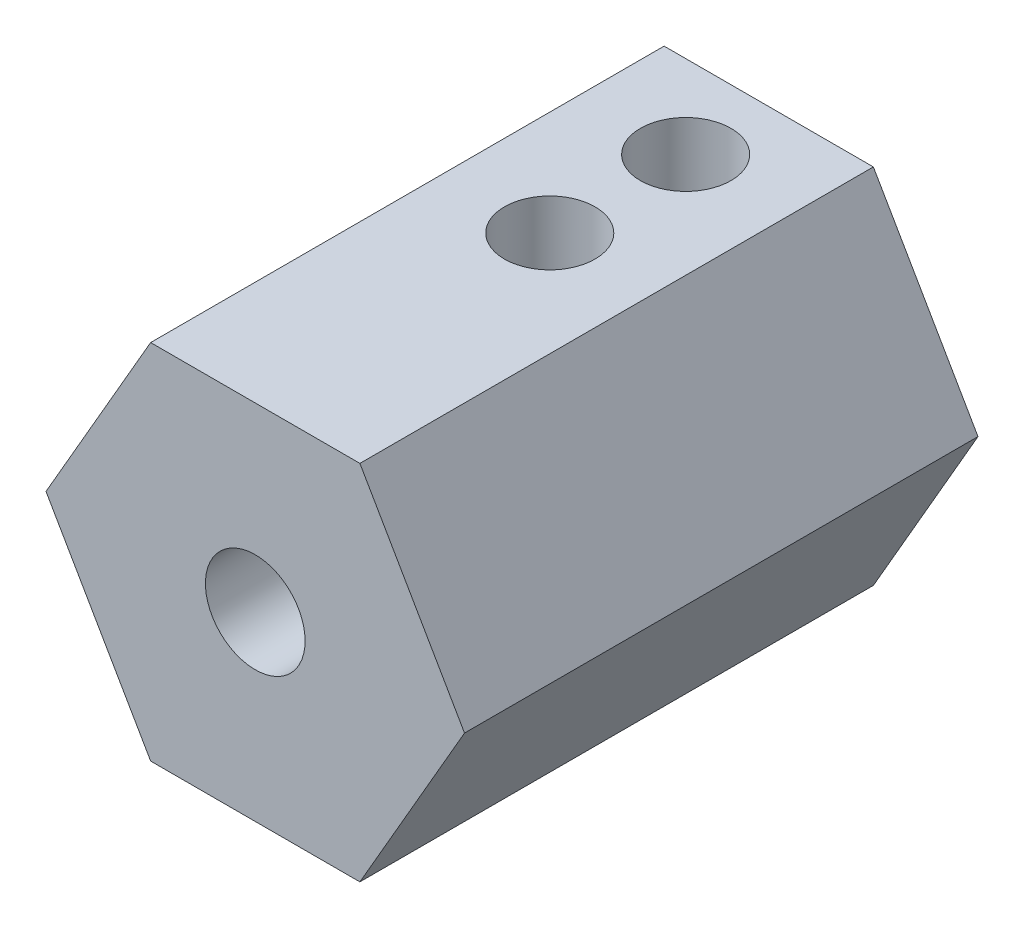
ISO-10303-21;
HEADER;
FILE_DESCRIPTION(('STEP AP214'),'2;1');
FILE_NAME('part.step','',(''),(''),'','','');
FILE_SCHEMA(('AUTOMOTIVE_DESIGN { 1 0 10303 214 1 1 1 1 }'));
ENDSEC;
DATA;
#1=APPLICATION_CONTEXT('core data for automotive mechanical design processes');
#2=APPLICATION_PROTOCOL_DEFINITION('international standard','automotive_design',2000,#1);
#3=PRODUCT_CONTEXT('',#1,'mechanical');
#4=PRODUCT('Part','Part','',(#3));
#5=PRODUCT_RELATED_PRODUCT_CATEGORY('part','',(#4));
#6=PRODUCT_DEFINITION_FORMATION('','',#4);
#7=PRODUCT_DEFINITION_CONTEXT('part definition',#1,'design');
#8=PRODUCT_DEFINITION('design','',#6,#7);
#9=PRODUCT_DEFINITION_SHAPE('','',#8);
#10=(LENGTH_UNIT() NAMED_UNIT(*) SI_UNIT(.MILLI.,.METRE.));
#11=(NAMED_UNIT(*) PLANE_ANGLE_UNIT() SI_UNIT($,.RADIAN.));
#12=(NAMED_UNIT(*) SI_UNIT($,.STERADIAN.) SOLID_ANGLE_UNIT());
#13=UNCERTAINTY_MEASURE_WITH_UNIT(LENGTH_MEASURE(1.E-05),#10,'distance_accuracy_value','');
#14=(GEOMETRIC_REPRESENTATION_CONTEXT(3) GLOBAL_UNCERTAINTY_ASSIGNED_CONTEXT((#13)) GLOBAL_UNIT_ASSIGNED_CONTEXT((#10,
#11,#12)) REPRESENTATION_CONTEXT('',''));
#15=CARTESIAN_POINT('',(0.,0.,0.));
#16=DIRECTION('',(0.,0.,1.));
#17=DIRECTION('',(1.,0.,0.));
#18=AXIS2_PLACEMENT_3D('',#15,#16,#17);
#19=CARTESIAN_POINT('',(0.,0.,1.5));
#20=DIRECTION('',(0.,0.,1.));
#21=DIRECTION('',(1.,0.,0.));
#22=AXIS2_PLACEMENT_3D('',#19,#20,#21);
#23=PLANE('',#22);
#24=CARTESIAN_POINT('',(0.,0.,1.5));
#25=DIRECTION('',(0.,0.,1.));
#26=DIRECTION('',(1.,0.,0.));
#27=AXIS2_PLACEMENT_3D('',#24,#25,#26);
#28=CIRCLE('',#27,2.);
#29=CARTESIAN_POINT('',(2.,0.,1.5));
#30=VERTEX_POINT('',#29);
#31=EDGE_CURVE('E140',#30,#30,#28,.F.);
#32=ORIENTED_EDGE('',*,*,#31,.T.);
#33=EDGE_LOOP('',(#32));
#34=FACE_BOUND('',#33,.T.);
#35=CARTESIAN_POINT('',(0.,0.,1.5));
#36=DIRECTION('',(0.,0.,1.));
#37=DIRECTION('',(1.,0.,0.));
#38=AXIS2_PLACEMENT_3D('',#35,#36,#37);
#39=CIRCLE('',#38,1.65);
#40=CARTESIAN_POINT('',(1.65,0.,1.5));
#41=VERTEX_POINT('',#40);
#42=EDGE_CURVE('E205',#41,#41,#39,.F.);
#43=ORIENTED_EDGE('',*,*,#42,.F.);
#44=EDGE_LOOP('',(#43));
#45=FACE_BOUND('',#44,.T.);
#46=ADVANCED_FACE('F44',(#34,#45),#23,.F.);
#47=CARTESIAN_POINT('',(6.92820323027551,0.,8.5));
#48=DIRECTION('',(-0.866025403784438,-0.5,0.));
#49=DIRECTION('',(0.5,-0.866025403784438,0.));
#50=AXIS2_PLACEMENT_3D('',#47,#48,#49);
#51=PLANE('',#50);
#52=DIRECTION('',(-0.5,0.866025403784438,0.));
#53=VECTOR('',#52,1.);
#54=CARTESIAN_POINT('',(6.92820323027551,0.,-8.5));
#55=LINE('',#54,#53);
#56=CARTESIAN_POINT('',(6.92820323027551,0.,-8.5));
#57=VERTEX_POINT('',#56);
#58=CARTESIAN_POINT('',(3.46410161513775,6.,-8.5));
#59=VERTEX_POINT('',#58);
#60=EDGE_CURVE('E135',#57,#59,#55,.T.);
#61=ORIENTED_EDGE('',*,*,#60,.T.);
#62=DIRECTION('',(0.,0.,-1.));
#63=VECTOR('',#62,1.);
#64=CARTESIAN_POINT('',(3.46410161513775,6.,8.5));
#65=LINE('',#64,#63);
#66=CARTESIAN_POINT('',(3.46410161513775,6.,8.5));
#67=VERTEX_POINT('',#66);
#68=EDGE_CURVE('E11',#67,#59,#65,.T.);
#69=ORIENTED_EDGE('',*,*,#68,.F.);
#70=DIRECTION('',(-0.5,0.866025403784438,0.));
#71=VECTOR('',#70,1.);
#72=CARTESIAN_POINT('',(6.92820323027551,0.,8.5));
#73=LINE('',#72,#71);
#74=CARTESIAN_POINT('',(6.92820323027551,0.,8.5));
#75=VERTEX_POINT('',#74);
#76=EDGE_CURVE('E152',#75,#67,#73,.T.);
#77=ORIENTED_EDGE('',*,*,#76,.F.);
#78=DIRECTION('',(0.,0.,-1.));
#79=VECTOR('',#78,1.);
#80=CARTESIAN_POINT('',(6.92820323027551,0.,8.5));
#81=LINE('',#80,#79);
#82=EDGE_CURVE('E131',#75,#57,#81,.T.);
#83=ORIENTED_EDGE('',*,*,#82,.T.);
#84=EDGE_LOOP('',(#61,#69,#77,#83));
#85=FACE_BOUND('',#84,.T.);
#86=ADVANCED_FACE('F46',(#85),#51,.F.);
#87=CARTESIAN_POINT('',(3.46410161513775,6.,8.5));
#88=DIRECTION('',(0.,-1.,0.));
#89=DIRECTION('',(1.,0.,0.));
#90=AXIS2_PLACEMENT_3D('',#87,#88,#89);
#91=PLANE('',#90);
#92=CARTESIAN_POINT('',(0.,6.,-5.75));
#93=DIRECTION('',(0.,1.,0.));
#94=DIRECTION('',(0.,0.,1.));
#95=AXIS2_PLACEMENT_3D('',#92,#93,#94);
#96=CIRCLE('',#95,1.5);
#97=CARTESIAN_POINT('',(0.,6.,-4.25));
#98=VERTEX_POINT('',#97);
#99=EDGE_CURVE('E262',#98,#98,#96,.T.);
#100=ORIENTED_EDGE('',*,*,#99,.F.);
#101=EDGE_LOOP('',(#100));
#102=FACE_BOUND('',#101,.T.);
#103=CARTESIAN_POINT('',(0.,6.,-1.25));
#104=DIRECTION('',(0.,1.,0.));
#105=DIRECTION('',(0.,0.,1.));
#106=AXIS2_PLACEMENT_3D('',#103,#104,#105);
#107=CIRCLE('',#106,1.5);
#108=CARTESIAN_POINT('',(0.,6.,0.249999999999999));
#109=VERTEX_POINT('',#108);
#110=EDGE_CURVE('E243',#109,#109,#107,.T.);
#111=ORIENTED_EDGE('',*,*,#110,.F.);
#112=EDGE_LOOP('',(#111));
#113=FACE_BOUND('',#112,.T.);
#114=DIRECTION('',(-1.,0.,0.));
#115=VECTOR('',#114,1.);
#116=CARTESIAN_POINT('',(3.46410161513775,6.,-8.5));
#117=LINE('',#116,#115);
#118=CARTESIAN_POINT('',(-3.46410161513775,6.,-8.5));
#119=VERTEX_POINT('',#118);
#120=EDGE_CURVE('E139',#59,#119,#117,.T.);
#121=ORIENTED_EDGE('',*,*,#120,.T.);
#122=DIRECTION('',(0.,0.,-1.));
#123=VECTOR('',#122,1.);
#124=CARTESIAN_POINT('',(-3.46410161513775,6.,8.5));
#125=LINE('',#124,#123);
#126=CARTESIAN_POINT('',(-3.46410161513775,6.,8.5));
#127=VERTEX_POINT('',#126);
#128=EDGE_CURVE('E54',#127,#119,#125,.T.);
#129=ORIENTED_EDGE('',*,*,#128,.F.);
#130=DIRECTION('',(-1.,0.,0.));
#131=VECTOR('',#130,1.);
#132=CARTESIAN_POINT('',(3.46410161513775,6.,8.5));
#133=LINE('',#132,#131);
#134=EDGE_CURVE('E99',#67,#127,#133,.T.);
#135=ORIENTED_EDGE('',*,*,#134,.F.);
#136=ORIENTED_EDGE('',*,*,#68,.T.);
#137=EDGE_LOOP('',(#121,#129,#135,#136));
#138=FACE_BOUND('',#137,.T.);
#139=ADVANCED_FACE('F187',(#102,#113,#138),#91,.F.);
#140=CARTESIAN_POINT('',(-3.46410161513775,6.,8.5));
#141=DIRECTION('',(0.866025403784439,-0.5,0.));
#142=DIRECTION('',(0.5,0.866025403784439,0.));
#143=AXIS2_PLACEMENT_3D('',#140,#141,#142);
#144=PLANE('',#143);
#145=DIRECTION('',(-0.5,-0.866025403784439,0.));
#146=VECTOR('',#145,1.);
#147=CARTESIAN_POINT('',(-3.46410161513775,6.,-8.5));
#148=LINE('',#147,#146);
#149=CARTESIAN_POINT('',(-6.92820323027551,0.,-8.5));
#150=VERTEX_POINT('',#149);
#151=EDGE_CURVE('E143',#119,#150,#148,.T.);
#152=ORIENTED_EDGE('',*,*,#151,.T.);
#153=DIRECTION('',(0.,0.,-1.));
#154=VECTOR('',#153,1.);
#155=CARTESIAN_POINT('',(-6.92820323027551,0.,8.5));
#156=LINE('',#155,#154);
#157=CARTESIAN_POINT('',(-6.92820323027551,0.,8.5));
#158=VERTEX_POINT('',#157);
#159=EDGE_CURVE('E123',#158,#150,#156,.T.);
#160=ORIENTED_EDGE('',*,*,#159,.F.);
#161=DIRECTION('',(-0.5,-0.866025403784439,0.));
#162=VECTOR('',#161,1.);
#163=CARTESIAN_POINT('',(-3.46410161513775,6.,8.5));
#164=LINE('',#163,#162);
#165=EDGE_CURVE('E112',#127,#158,#164,.T.);
#166=ORIENTED_EDGE('',*,*,#165,.F.);
#167=ORIENTED_EDGE('',*,*,#128,.T.);
#168=EDGE_LOOP('',(#152,#160,#166,#167));
#169=FACE_BOUND('',#168,.T.);
#170=ADVANCED_FACE('F163',(#169),#144,.F.);
#171=CARTESIAN_POINT('',(-6.92820323027551,0.,8.5));
#172=DIRECTION('',(0.866025403784438,0.500000000000001,0.));
#173=DIRECTION('',(-0.500000000000001,0.866025403784438,0.));
#174=AXIS2_PLACEMENT_3D('',#171,#172,#173);
#175=PLANE('',#174);
#176=DIRECTION('',(0.500000000000001,-0.866025403784438,0.));
#177=VECTOR('',#176,1.);
#178=CARTESIAN_POINT('',(-6.92820323027551,0.,-8.5));
#179=LINE('',#178,#177);
#180=CARTESIAN_POINT('',(-3.46410161513775,-6.,-8.5));
#181=VERTEX_POINT('',#180);
#182=EDGE_CURVE('E121',#150,#181,#179,.T.);
#183=ORIENTED_EDGE('',*,*,#182,.T.);
#184=DIRECTION('',(0.,0.,-1.));
#185=VECTOR('',#184,1.);
#186=CARTESIAN_POINT('',(-3.46410161513775,-6.,8.5));
#187=LINE('',#186,#185);
#188=CARTESIAN_POINT('',(-3.46410161513775,-6.,8.5));
#189=VERTEX_POINT('',#188);
#190=EDGE_CURVE('E118',#189,#181,#187,.T.);
#191=ORIENTED_EDGE('',*,*,#190,.F.);
#192=DIRECTION('',(0.500000000000001,-0.866025403784438,0.));
#193=VECTOR('',#192,1.);
#194=CARTESIAN_POINT('',(-6.92820323027551,0.,8.5));
#195=LINE('',#194,#193);
#196=EDGE_CURVE('E106',#158,#189,#195,.T.);
#197=ORIENTED_EDGE('',*,*,#196,.F.);
#198=ORIENTED_EDGE('',*,*,#159,.T.);
#199=EDGE_LOOP('',(#183,#191,#197,#198));
#200=FACE_BOUND('',#199,.T.);
#201=ADVANCED_FACE('F119',(#200),#175,.F.);
#202=CARTESIAN_POINT('',(-3.46410161513775,-6.,8.5));
#203=DIRECTION('',(0.,1.,0.));
#204=DIRECTION('',(-1.,0.,0.));
#205=AXIS2_PLACEMENT_3D('',#202,#203,#204);
#206=PLANE('',#205);
#207=DIRECTION('',(1.,0.,0.));
#208=VECTOR('',#207,1.);
#209=CARTESIAN_POINT('',(-3.46410161513775,-6.,-8.5));
#210=LINE('',#209,#208);
#211=CARTESIAN_POINT('',(3.46410161513775,-6.,-8.5));
#212=VERTEX_POINT('',#211);
#213=EDGE_CURVE('E85',#181,#212,#210,.T.);
#214=ORIENTED_EDGE('',*,*,#213,.T.);
#215=DIRECTION('',(0.,0.,-1.));
#216=VECTOR('',#215,1.);
#217=CARTESIAN_POINT('',(3.46410161513775,-6.,8.5));
#218=LINE('',#217,#216);
#219=CARTESIAN_POINT('',(3.46410161513775,-6.,8.5));
#220=VERTEX_POINT('',#219);
#221=EDGE_CURVE('E124',#220,#212,#218,.T.);
#222=ORIENTED_EDGE('',*,*,#221,.F.);
#223=DIRECTION('',(1.,0.,0.));
#224=VECTOR('',#223,1.);
#225=CARTESIAN_POINT('',(-3.46410161513775,-6.,8.5));
#226=LINE('',#225,#224);
#227=EDGE_CURVE('E110',#189,#220,#226,.T.);
#228=ORIENTED_EDGE('',*,*,#227,.F.);
#229=ORIENTED_EDGE('',*,*,#190,.T.);
#230=EDGE_LOOP('',(#214,#222,#228,#229));
#231=FACE_BOUND('',#230,.T.);
#232=ADVANCED_FACE('F126',(#231),#206,.F.);
#233=CARTESIAN_POINT('',(3.46410161513775,-6.,8.5));
#234=DIRECTION('',(-0.866025403784439,0.5,0.));
#235=DIRECTION('',(-0.5,-0.866025403784439,0.));
#236=AXIS2_PLACEMENT_3D('',#233,#234,#235);
#237=PLANE('',#236);
#238=DIRECTION('',(0.5,0.866025403784439,0.));
#239=VECTOR('',#238,1.);
#240=CARTESIAN_POINT('',(3.46410161513775,-6.,-8.5));
#241=LINE('',#240,#239);
#242=EDGE_CURVE('E91',#212,#57,#241,.T.);
#243=ORIENTED_EDGE('',*,*,#242,.T.);
#244=ORIENTED_EDGE('',*,*,#82,.F.);
#245=DIRECTION('',(0.5,0.866025403784439,0.));
#246=VECTOR('',#245,1.);
#247=CARTESIAN_POINT('',(3.46410161513775,-6.,8.5));
#248=LINE('',#247,#246);
#249=EDGE_CURVE('E62',#220,#75,#248,.T.);
#250=ORIENTED_EDGE('',*,*,#249,.F.);
#251=ORIENTED_EDGE('',*,*,#221,.T.);
#252=EDGE_LOOP('',(#243,#244,#250,#251));
#253=FACE_BOUND('',#252,.T.);
#254=ADVANCED_FACE('F170',(#253),#237,.F.);
#255=CARTESIAN_POINT('',(0.,0.,8.5));
#256=DIRECTION('',(0.,0.,1.));
#257=DIRECTION('',(1.,0.,0.));
#258=AXIS2_PLACEMENT_3D('',#255,#256,#257);
#259=PLANE('',#258);
#260=CARTESIAN_POINT('',(0.,0.,8.5));
#261=DIRECTION('',(0.,0.,1.));
#262=DIRECTION('',(1.,0.,0.));
#263=AXIS2_PLACEMENT_3D('',#260,#261,#262);
#264=CIRCLE('',#263,1.65);
#265=CARTESIAN_POINT('',(1.65,0.,8.5));
#266=VERTEX_POINT('',#265);
#267=EDGE_CURVE('E212',#266,#266,#264,.T.);
#268=ORIENTED_EDGE('',*,*,#267,.F.);
#269=EDGE_LOOP('',(#268));
#270=FACE_BOUND('',#269,.T.);
#271=ORIENTED_EDGE('',*,*,#76,.T.);
#272=ORIENTED_EDGE('',*,*,#134,.T.);
#273=ORIENTED_EDGE('',*,*,#165,.T.);
#274=ORIENTED_EDGE('',*,*,#196,.T.);
#275=ORIENTED_EDGE('',*,*,#227,.T.);
#276=ORIENTED_EDGE('',*,*,#249,.T.);
#277=EDGE_LOOP('',(#271,#272,#273,#274,#275,#276));
#278=FACE_BOUND('',#277,.T.);
#279=ADVANCED_FACE('F108',(#270,#278),#259,.T.);
#280=CARTESIAN_POINT('',(0.,0.,-8.5));
#281=DIRECTION('',(0.,0.,1.));
#282=DIRECTION('',(1.,0.,0.));
#283=AXIS2_PLACEMENT_3D('',#280,#281,#282);
#284=PLANE('',#283);
#285=CARTESIAN_POINT('',(0.,0.,-8.5));
#286=DIRECTION('',(0.,0.,-1.));
#287=DIRECTION('',(-1.,0.,0.));
#288=AXIS2_PLACEMENT_3D('',#285,#286,#287);
#289=CIRCLE('',#288,2.);
#290=CARTESIAN_POINT('',(-2.,0.,-8.5));
#291=VERTEX_POINT('',#290);
#292=EDGE_CURVE('E202',#291,#291,#289,.T.);
#293=ORIENTED_EDGE('',*,*,#292,.F.);
#294=EDGE_LOOP('',(#293));
#295=FACE_BOUND('',#294,.T.);
#296=ORIENTED_EDGE('',*,*,#60,.F.);
#297=ORIENTED_EDGE('',*,*,#242,.F.);
#298=ORIENTED_EDGE('',*,*,#213,.F.);
#299=ORIENTED_EDGE('',*,*,#182,.F.);
#300=ORIENTED_EDGE('',*,*,#151,.F.);
#301=ORIENTED_EDGE('',*,*,#120,.F.);
#302=EDGE_LOOP('',(#296,#297,#298,#299,#300,#301));
#303=FACE_BOUND('',#302,.T.);
#304=ADVANCED_FACE('F166',(#295,#303),#284,.F.);
#305=CARTESIAN_POINT('',(0.,0.,7.15685424949238));
#306=DIRECTION('',(0.,0.,-1.));
#307=DIRECTION('',(-1.,0.,0.));
#308=AXIS2_PLACEMENT_3D('',#305,#306,#307);
#309=CYLINDRICAL_SURFACE('',#308,2.);
#310=CARTESIAN_POINT('',(0.,2.,-4.25));
#311=CARTESIAN_POINT('',(0.0732207358411528,1.99999540196395,-4.25000479201203));
#312=CARTESIAN_POINT('',(0.146561062021484,1.99593645526274,-4.2554050243745));
#313=CARTESIAN_POINT('',(0.290936396286465,1.98006607281083,-4.27666706341016));
#314=CARTESIAN_POINT('',(0.361965136229002,1.96823514679854,-4.29255517165006));
#315=CARTESIAN_POINT('',(0.499234626631247,1.9379567495606,-4.33371290928377));
#316=CARTESIAN_POINT('',(0.565501615403735,1.91954951932009,-4.35892551356918));
#317=CARTESIAN_POINT('',(0.69242233552075,1.87750556721694,-4.41754234418723));
#318=CARTESIAN_POINT('',(0.75307770179633,1.85387037535483,-4.45094417419352));
#319=CARTESIAN_POINT('',(0.873465937590142,1.80049544543983,-4.52826301159082));
#320=CARTESIAN_POINT('',(0.932593229272029,1.7703930854844,-4.57286732933407));
#321=CARTESIAN_POINT('',(1.0430271676767,1.70767017883378,-4.66949583736117));
#322=CARTESIAN_POINT('',(1.09432148272226,1.67504578078609,-4.72153148279983));
#323=CARTESIAN_POINT('',(1.19837161436623,1.6027112365199,-4.84358295327837));
#324=CARTESIAN_POINT('',(1.24930578421204,1.56290854864639,-4.9151036771217));
#325=CARTESIAN_POINT('',(1.33861998176348,1.48711444664135,-5.06745101236655));
#326=CARTESIAN_POINT('',(1.37701716983077,1.45111786883676,-5.14826469700031));
#327=CARTESIAN_POINT('',(1.42880627811788,1.39977155180179,-5.28950283867623));
#328=CARTESIAN_POINT('',(1.44625674456539,1.38157751186734,-5.34739069712838));
#329=CARTESIAN_POINT('',(1.47420672564844,1.35171594150685,-5.46639273478492));
#330=CARTESIAN_POINT('',(1.48472215355267,1.34003347910832,-5.52749917787479));
#331=CARTESIAN_POINT('',(1.49812822141445,1.32503759684553,-5.65218258553077));
#332=CARTESIAN_POINT('',(1.50094954854207,1.32180026676597,-5.71577680672405));
#333=CARTESIAN_POINT('',(1.49848213241868,1.32459531776068,-5.84261491088157));
#334=CARTESIAN_POINT('',(1.49319048157349,1.33063102218114,-5.90585866008744));
#335=CARTESIAN_POINT('',(1.47597739291882,1.34967623262519,-6.02319134742579));
#336=CARTESIAN_POINT('',(1.46482486380817,1.36187157059871,-6.07753637104619));
#337=CARTESIAN_POINT('',(1.43705671120732,1.39114192844939,-6.18343887872088));
#338=CARTESIAN_POINT('',(1.42043583681172,1.40822163640769,-6.2349936278236));
#339=CARTESIAN_POINT('',(1.37033064172534,1.45741769294306,-6.36625638663415));
#340=CARTESIAN_POINT('',(1.3328014849398,1.49225649139233,-6.44340041664351));
#341=CARTESIAN_POINT('',(1.24618023314519,1.56533298145196,-6.58919652386909));
#342=CARTESIAN_POINT('',(1.19706004255878,1.6035787888611,-6.65782733925466));
#343=CARTESIAN_POINT('',(1.08651604102135,1.68051672313145,-6.78775339040366));
#344=CARTESIAN_POINT('',(1.02481375526036,1.7191958673024,-6.84882060688148));
#345=CARTESIAN_POINT('',(0.890422521709586,1.79248037980973,-6.96026364678117));
#346=CARTESIAN_POINT('',(0.817755054293752,1.8270934826376,-7.01065992023038));
#347=CARTESIAN_POINT('',(0.677902080454138,1.88279726073643,-7.08998079924033));
#348=CARTESIAN_POINT('',(0.612539870185616,1.90520770945008,-7.12118459421578));
#349=CARTESIAN_POINT('',(0.476352173202082,1.94372904416948,-7.17422488046387));
#350=CARTESIAN_POINT('',(0.405530141063762,1.95984387504352,-7.19606723849928));
#351=CARTESIAN_POINT('',(0.259676232483515,1.98445588635989,-7.22925336288644));
#352=CARTESIAN_POINT('',(0.184621281405939,1.99290592971749,-7.24053217893863));
#353=CARTESIAN_POINT('',(0.033201239796914,2.00115883659445,-7.25154959737171));
#354=CARTESIAN_POINT('',(-0.0431632843727267,2.00096534845408,-7.25129306869537));
#355=CARTESIAN_POINT('',(-0.186804217329629,1.99242547175873,-7.23988913072681));
#356=CARTESIAN_POINT('',(-0.254222327546136,1.98490086600401,-7.22983946311133));
#357=CARTESIAN_POINT('',(-0.386110670609121,1.96351320201588,-7.20102621999213));
#358=CARTESIAN_POINT('',(-0.450580272987264,1.94964879507262,-7.18226079031059));
#359=CARTESIAN_POINT('',(-0.577416779689772,1.91599830683313,-7.1361124694069));
#360=CARTESIAN_POINT('',(-0.639629172536141,1.89602050290193,-7.1084488185726));
#361=CARTESIAN_POINT('',(-0.758518527043075,1.85166985411963,-7.04582754457441));
#362=CARTESIAN_POINT('',(-0.815194721336405,1.82729640132067,-7.01086891236026));
#363=CARTESIAN_POINT('',(-0.931511626319039,1.77119146886499,-6.92821675358944));
#364=CARTESIAN_POINT('',(-0.990066762698704,1.73891095025037,-6.87937146056254));
#365=CARTESIAN_POINT('',(-1.09871974855854,1.67238952874785,-6.77399124741161));
#366=CARTESIAN_POINT('',(-1.14879830469577,1.63814438507395,-6.71743930030664));
#367=CARTESIAN_POINT('',(-1.24877541075626,1.56369128291496,-6.58585011903882));
#368=CARTESIAN_POINT('',(-1.29683043648705,1.523587185201,-6.5093424385077));
#369=CARTESIAN_POINT('',(-1.37923235998283,1.4494059134845,-6.34663992202754));
#370=CARTESIAN_POINT('',(-1.41362000515519,1.41531099570969,-6.26047487809142));
#371=CARTESIAN_POINT('',(-1.45615734256767,1.37118877808582,-6.11458555112552));
#372=CARTESIAN_POINT('',(-1.46931009512996,1.35695811824564,-6.05760887359762));
#373=CARTESIAN_POINT('',(-1.48891522181906,1.3354205610301,-5.94129295301682));
#374=CARTESIAN_POINT('',(-1.4953825519924,1.32809821220233,-5.88195929319775));
#375=CARTESIAN_POINT('',(-1.50115320209064,1.32157601792209,-5.76217092018867));
#376=CARTESIAN_POINT('',(-1.50042015325262,1.32241740684975,-5.70171205699043));
#377=CARTESIAN_POINT('',(-1.49176883838219,1.33216448543666,-5.58194316124784));
#378=CARTESIAN_POINT('',(-1.48384130024585,1.34108058157484,-5.52263471210274));
#379=CARTESIAN_POINT('',(-1.45893841819723,1.36817348797773,-5.3940854285892));
#380=CARTESIAN_POINT('',(-1.44036567954111,1.38794705950643,-5.32550281986723));
#381=CARTESIAN_POINT('',(-1.39469627266119,1.4338296338541,-5.19346515116951));
#382=CARTESIAN_POINT('',(-1.3675780729773,1.4599546014693,-5.13002355796181));
#383=CARTESIAN_POINT('',(-1.29498918933642,1.52516477328824,-4.98747936951367));
#384=CARTESIAN_POINT('',(-1.2464154206597,1.56560203191105,-4.91057841724425));
#385=CARTESIAN_POINT('',(-1.13650718465936,1.64713510181273,-4.76687395502244));
#386=CARTESIAN_POINT('',(-1.07516134758577,1.68823146954222,-4.70007953405515));
#387=CARTESIAN_POINT('',(-0.939627144937891,1.76728988939793,-4.57716815771667));
#388=CARTESIAN_POINT('',(-0.86533716156286,1.80522333711072,-4.52114368062281));
#389=CARTESIAN_POINT('',(-0.705159098936203,1.87357289668097,-4.42277694885465));
#390=CARTESIAN_POINT('',(-0.619299420401793,1.90400691592959,-4.3804020254275));
#391=CARTESIAN_POINT('',(-0.464840290356454,1.94636704624048,-4.32220057901429));
#392=CARTESIAN_POINT('',(-0.398553614774732,1.96110322499718,-4.30223326862383));
#393=CARTESIAN_POINT('',(-0.26284161039276,1.98383739970238,-4.27158209738851));
#394=CARTESIAN_POINT('',(-0.193425623834905,1.99185421210894,-4.26087230975004));
#395=CARTESIAN_POINT('',(-0.102963309861889,1.99745471706309,-4.25339530578565));
#396=CARTESIAN_POINT('',(-0.0824069459941241,1.9984076143208,-4.25212372251059));
#397=CARTESIAN_POINT('',(-0.0412368896243792,1.99968095423138,-4.25042532676903));
#398=CARTESIAN_POINT('',(-0.0206231884283893,2.00000129507253,-4.24999865029263));
#399=CARTESIAN_POINT('',(0.,2.,-4.25));
#400=B_SPLINE_CURVE_WITH_KNOTS('',3,(#310,#311,#312,#313,#314,#315,#316,#317,#318,#319,#320,
#321,#322,#323,#324,#325,#326,#327,#328,#329,#330,#331,#332,#333,#334,#335,#336,#337,#338,#339,
#340,#341,#342,#343,#344,#345,#346,#347,#348,#349,#350,#351,#352,#353,#354,#355,#356,#357,#358,
#359,#360,#361,#362,#363,#364,#365,#366,#367,#368,#369,#370,#371,#372,#373,#374,#375,#376,#377,
#378,#379,#380,#381,#382,#383,#384,#385,#386,#387,#388,#389,#390,#391,#392,#393,#394,#395,#396,
#397,#398,#399),.UNSPECIFIED.,.T.,.F.,(4,2,2,2,2,2,2,2,2,2,2,2,2,2,2,2,2,2,2,2,2,2,2,2,2,2,2,2,
2,2,2,2,2,2,2,2,2,2,2,2,2,2,2,2,4),(0.,0.219571786572042,0.439696319423243,0.65849633357338,
0.877232398849292,1.11622431317429,1.35558868405162,1.64360015887451,1.93121574056506,
2.11999518529901,2.3083399319529,2.49837587621256,2.68847994300209,2.85826890162709,
3.0282213760064,3.3044933180591,3.58144192357889,3.8653588393809,4.14872662493691,
4.37526505006389,4.60166129643117,4.82944058166898,5.05712372466613,5.26191187011994,
5.46674360185812,5.67880439483679,5.89089453977541,6.13840382081867,6.38646908985451,
6.68168596015947,6.97601595850112,7.15589161422933,7.33536399114208,7.51574333854741,
7.69635548563854,7.91639670960134,8.13699685139921,8.43412246655768,8.73151372390893,
9.0313544949265,9.33047220273164,9.5419569754163,9.75284752283256,9.81468166878711,
9.87652576630965),.UNSPECIFIED.);
#401=CARTESIAN_POINT('',(0.,2.,-4.25));
#402=VERTEX_POINT('',#401);
#403=EDGE_CURVE('E255',#402,#402,#400,.T.);
#404=ORIENTED_EDGE('',*,*,#403,.T.);
#405=EDGE_LOOP('',(#404));
#406=FACE_BOUND('',#405,.T.);
#407=CARTESIAN_POINT('',(0.,2.,0.249999999999998));
#408=CARTESIAN_POINT('',(0.0732207358411534,1.99999540196395,0.249995207987975));
#409=CARTESIAN_POINT('',(0.146561062021484,1.99593645526274,0.244594975625502));
#410=CARTESIAN_POINT('',(0.290936396286466,1.98006607281083,0.223332936589838));
#411=CARTESIAN_POINT('',(0.361965136229003,1.96823514679854,0.207444828349943));
#412=CARTESIAN_POINT('',(0.499234626631248,1.9379567495606,0.166287090716228));
#413=CARTESIAN_POINT('',(0.565501615403735,1.91954951932009,0.141074486430824));
#414=CARTESIAN_POINT('',(0.692422335520751,1.87750556721694,0.0824576558127699));
#415=CARTESIAN_POINT('',(0.75307770179633,1.85387037535483,0.0490558258064804));
#416=CARTESIAN_POINT('',(0.873465937590143,1.80049544543983,-0.0282630115908232));
#417=CARTESIAN_POINT('',(0.93259322927203,1.7703930854844,-0.0728673293340733));
#418=CARTESIAN_POINT('',(1.0430271676767,1.70767017883378,-0.169495837361173));
#419=CARTESIAN_POINT('',(1.09432148272226,1.67504578078609,-0.221531482799834));
#420=CARTESIAN_POINT('',(1.19837161436623,1.6027112365199,-0.343582953278368));
#421=CARTESIAN_POINT('',(1.24930578421204,1.56290854864639,-0.415103677121705));
#422=CARTESIAN_POINT('',(1.33861998176348,1.48711444664135,-0.567451012366546));
#423=CARTESIAN_POINT('',(1.37701716983077,1.45111786883676,-0.64826469700031));
#424=CARTESIAN_POINT('',(1.42880627811788,1.39977155180179,-0.789502838676234));
#425=CARTESIAN_POINT('',(1.44625674456539,1.38157751186734,-0.847390697128382));
#426=CARTESIAN_POINT('',(1.47420672564844,1.35171594150685,-0.966392734784921));
#427=CARTESIAN_POINT('',(1.48472215355267,1.34003347910832,-1.02749917787479));
#428=CARTESIAN_POINT('',(1.49812822141445,1.32503759684553,-1.15218258553077));
#429=CARTESIAN_POINT('',(1.50094954854207,1.32180026676597,-1.21577680672406));
#430=CARTESIAN_POINT('',(1.49848213241868,1.32459531776068,-1.34261491088158));
#431=CARTESIAN_POINT('',(1.49319048157349,1.33063102218114,-1.40585866008744));
#432=CARTESIAN_POINT('',(1.47597739291882,1.34967623262519,-1.52319134742579));
#433=CARTESIAN_POINT('',(1.46482486380817,1.36187157059871,-1.57753637104619));
#434=CARTESIAN_POINT('',(1.43705671120732,1.39114192844939,-1.68343887872088));
#435=CARTESIAN_POINT('',(1.42043583681172,1.40822163640769,-1.7349936278236));
#436=CARTESIAN_POINT('',(1.37033064172534,1.45741769294306,-1.86625638663415));
#437=CARTESIAN_POINT('',(1.3328014849398,1.49225649139233,-1.94340041664351));
#438=CARTESIAN_POINT('',(1.24618023314519,1.56533298145196,-2.08919652386909));
#439=CARTESIAN_POINT('',(1.19706004255878,1.60357878886109,-2.15782733925466));
#440=CARTESIAN_POINT('',(1.08651604102135,1.68051672313145,-2.28775339040365));
#441=CARTESIAN_POINT('',(1.02481375526036,1.7191958673024,-2.34882060688148));
#442=CARTESIAN_POINT('',(0.890422521709588,1.79248037980973,-2.46026364678116));
#443=CARTESIAN_POINT('',(0.817755054293755,1.8270934826376,-2.51065992023038));
#444=CARTESIAN_POINT('',(0.677902080454141,1.88279726073643,-2.58998079924033));
#445=CARTESIAN_POINT('',(0.612539870185618,1.90520770945008,-2.62118459421578));
#446=CARTESIAN_POINT('',(0.476352173202085,1.94372904416948,-2.67422488046386));
#447=CARTESIAN_POINT('',(0.405530141063765,1.95984387504352,-2.69606723849928));
#448=CARTESIAN_POINT('',(0.259676232483517,1.98445588635989,-2.72925336288644));
#449=CARTESIAN_POINT('',(0.184621281405942,1.99290592971749,-2.74053217893863));
#450=CARTESIAN_POINT('',(0.0332012397969164,2.00115883659445,-2.75154959737171));
#451=CARTESIAN_POINT('',(-0.0431632843727243,2.00096534845408,-2.75129306869537));
#452=CARTESIAN_POINT('',(-0.186804217329626,1.99242547175873,-2.73988913072681));
#453=CARTESIAN_POINT('',(-0.254222327546134,1.98490086600401,-2.72983946311133));
#454=CARTESIAN_POINT('',(-0.386110670609119,1.96351320201588,-2.70102621999213));
#455=CARTESIAN_POINT('',(-0.450580272987261,1.94964879507262,-2.68226079031059));
#456=CARTESIAN_POINT('',(-0.57741677968977,1.91599830683313,-2.6361124694069));
#457=CARTESIAN_POINT('',(-0.639629172536139,1.89602050290193,-2.6084488185726));
#458=CARTESIAN_POINT('',(-0.758518527043073,1.85166985411963,-2.54582754457441));
#459=CARTESIAN_POINT('',(-0.815194721336403,1.82729640132068,-2.51086891236027));
#460=CARTESIAN_POINT('',(-0.931511626319037,1.77119146886499,-2.42821675358944));
#461=CARTESIAN_POINT('',(-0.990066762698702,1.73891095025037,-2.37937146056255));
#462=CARTESIAN_POINT('',(-1.09871974855854,1.67238952874785,-2.27399124741161));
#463=CARTESIAN_POINT('',(-1.14879830469577,1.63814438507395,-2.21743930030664));
#464=CARTESIAN_POINT('',(-1.24877541075626,1.56369128291497,-2.08585011903882));
#465=CARTESIAN_POINT('',(-1.29683043648705,1.523587185201,-2.0093424385077));
#466=CARTESIAN_POINT('',(-1.37923235998283,1.4494059134845,-1.84663992202755));
#467=CARTESIAN_POINT('',(-1.41362000515519,1.41531099570969,-1.76047487809143));
#468=CARTESIAN_POINT('',(-1.45615734256767,1.37118877808583,-1.61458555112552));
#469=CARTESIAN_POINT('',(-1.46931009512996,1.35695811824565,-1.55760887359762));
#470=CARTESIAN_POINT('',(-1.48891522181906,1.33542056103011,-1.44129295301682));
#471=CARTESIAN_POINT('',(-1.4953825519924,1.32809821220233,-1.38195929319775));
#472=CARTESIAN_POINT('',(-1.50115320209064,1.32157601792209,-1.26217092018867));
#473=CARTESIAN_POINT('',(-1.50042015325262,1.32241740684975,-1.20171205699043));
#474=CARTESIAN_POINT('',(-1.49176883838219,1.33216448543666,-1.08194316124784));
#475=CARTESIAN_POINT('',(-1.48384130024584,1.34108058157484,-1.02263471210274));
#476=CARTESIAN_POINT('',(-1.45893841819723,1.36817348797773,-0.894085428589201));
#477=CARTESIAN_POINT('',(-1.44036567954111,1.38794705950643,-0.825502819867227));
#478=CARTESIAN_POINT('',(-1.39469627266119,1.4338296338541,-0.693465151169516));
#479=CARTESIAN_POINT('',(-1.3675780729773,1.4599546014693,-0.630023557961813));
#480=CARTESIAN_POINT('',(-1.29498918933642,1.52516477328824,-0.487479369513667));
#481=CARTESIAN_POINT('',(-1.2464154206597,1.56560203191105,-0.410578417244247));
#482=CARTESIAN_POINT('',(-1.13650718465936,1.64713510181273,-0.266873955022437));
#483=CARTESIAN_POINT('',(-1.07516134758577,1.68823146954222,-0.200079534055155));
#484=CARTESIAN_POINT('',(-0.939627144937892,1.76728988939793,-0.0771681577166727));
#485=CARTESIAN_POINT('',(-0.865337161562861,1.80522333711072,-0.0211436806228079));
#486=CARTESIAN_POINT('',(-0.705159098936205,1.87357289668097,0.0772230511453488));
#487=CARTESIAN_POINT('',(-0.619299420401795,1.90400691592959,0.119597974572504));
#488=CARTESIAN_POINT('',(-0.464840290356455,1.94636704624048,0.177799420985705));
#489=CARTESIAN_POINT('',(-0.398553614774733,1.96110322499718,0.197766731376173));
#490=CARTESIAN_POINT('',(-0.262841610392761,1.98383739970238,0.228417902611489));
#491=CARTESIAN_POINT('',(-0.193425623834906,1.99185421210894,0.23912769024996));
#492=CARTESIAN_POINT('',(-0.10296330986189,1.99745471706309,0.246604694214347));
#493=CARTESIAN_POINT('',(-0.082406945994124,1.9984076143208,0.247876277489414));
#494=CARTESIAN_POINT('',(-0.0412368896243786,1.99968095423138,0.249574673230967));
#495=CARTESIAN_POINT('',(-0.0206231884283887,2.00000129507253,0.250001349707369));
#496=CARTESIAN_POINT('',(0.,2.,0.249999999999998));
#497=B_SPLINE_CURVE_WITH_KNOTS('',3,(#407,#408,#409,#410,#411,#412,#413,#414,#415,#416,#417,
#418,#419,#420,#421,#422,#423,#424,#425,#426,#427,#428,#429,#430,#431,#432,#433,#434,#435,#436,
#437,#438,#439,#440,#441,#442,#443,#444,#445,#446,#447,#448,#449,#450,#451,#452,#453,#454,#455,
#456,#457,#458,#459,#460,#461,#462,#463,#464,#465,#466,#467,#468,#469,#470,#471,#472,#473,#474,
#475,#476,#477,#478,#479,#480,#481,#482,#483,#484,#485,#486,#487,#488,#489,#490,#491,#492,#493,
#494,#495,#496),.UNSPECIFIED.,.T.,.F.,(4,2,2,2,2,2,2,2,2,2,2,2,2,2,2,2,2,2,2,2,2,2,2,2,2,2,2,2,
2,2,2,2,2,2,2,2,2,2,2,2,2,2,2,2,4),(0.,0.219571786572042,0.439696319423243,0.65849633357338,
0.877232398849291,1.1162243131743,1.35558868405162,1.64360015887451,1.93121574056506,
2.11999518529901,2.3083399319529,2.49837587621257,2.68847994300209,2.85826890162709,
3.0282213760064,3.3044933180591,3.58144192357889,3.8653588393809,4.1487266249369,
4.37526505006389,4.60166129643117,4.82944058166898,5.05712372466613,5.26191187011994,
5.46674360185812,5.67880439483679,5.89089453977541,6.13840382081867,6.38646908985451,
6.68168596015946,6.97601595850112,7.15589161422932,7.33536399114208,7.5157433385474,
7.69635548563854,7.91639670960134,8.13699685139921,8.43412246655767,8.73151372390892,
9.03135449492649,9.33047220273163,9.54195697541629,9.75284752283255,9.8146816687871,
9.87652576630965),.UNSPECIFIED.);
#498=CARTESIAN_POINT('',(0.,2.,0.249999999999998));
#499=VERTEX_POINT('',#498);
#500=EDGE_CURVE('E233',#499,#499,#497,.T.);
#501=ORIENTED_EDGE('',*,*,#500,.T.);
#502=EDGE_LOOP('',(#501));
#503=FACE_BOUND('',#502,.T.);
#504=ORIENTED_EDGE('',*,*,#292,.T.);
#505=EDGE_LOOP('',(#504));
#506=FACE_BOUND('',#505,.T.);
#507=ORIENTED_EDGE('',*,*,#31,.F.);
#508=EDGE_LOOP('',(#507));
#509=FACE_BOUND('',#508,.T.);
#510=ADVANCED_FACE('F191',(#406,#503,#506,#509),#309,.F.);
#511=CARTESIAN_POINT('',(0.,0.,8.5));
#512=DIRECTION('',(0.,0.,1.));
#513=DIRECTION('',(1.,0.,0.));
#514=AXIS2_PLACEMENT_3D('',#511,#512,#513);
#515=CYLINDRICAL_SURFACE('',#514,1.65);
#516=ORIENTED_EDGE('',*,*,#42,.T.);
#517=EDGE_LOOP('',(#516));
#518=FACE_BOUND('',#517,.T.);
#519=ORIENTED_EDGE('',*,*,#267,.T.);
#520=EDGE_LOOP('',(#519));
#521=FACE_BOUND('',#520,.T.);
#522=ADVANCED_FACE('F198',(#518,#521),#515,.F.);
#523=CARTESIAN_POINT('',(0.,6.,-1.25));
#524=DIRECTION('',(0.,1.,0.));
#525=DIRECTION('',(0.,0.,1.));
#526=AXIS2_PLACEMENT_3D('',#523,#524,#525);
#527=CYLINDRICAL_SURFACE('',#526,1.5);
#528=ORIENTED_EDGE('',*,*,#500,.F.);
#529=EDGE_LOOP('',(#528));
#530=FACE_BOUND('',#529,.T.);
#531=ORIENTED_EDGE('',*,*,#110,.T.);
#532=EDGE_LOOP('',(#531));
#533=FACE_BOUND('',#532,.T.);
#534=ADVANCED_FACE('F246',(#530,#533),#527,.F.);
#535=CARTESIAN_POINT('',(0.,6.,-5.75));
#536=DIRECTION('',(0.,1.,0.));
#537=DIRECTION('',(0.,0.,1.));
#538=AXIS2_PLACEMENT_3D('',#535,#536,#537);
#539=CYLINDRICAL_SURFACE('',#538,1.5);
#540=ORIENTED_EDGE('',*,*,#403,.F.);
#541=EDGE_LOOP('',(#540));
#542=FACE_BOUND('',#541,.T.);
#543=ORIENTED_EDGE('',*,*,#99,.T.);
#544=EDGE_LOOP('',(#543));
#545=FACE_BOUND('',#544,.T.);
#546=ADVANCED_FACE('F250',(#542,#545),#539,.F.);
#547=CLOSED_SHELL('',(#46,#86,#139,#170,#201,#232,#254,#279,#304,#510,#522,#534,#546));
#548=MANIFOLD_SOLID_BREP('B2',#547);
#549=ADVANCED_BREP_SHAPE_REPRESENTATION('',(#18,#548),#14);
#550=SHAPE_DEFINITION_REPRESENTATION(#9,#549);
ENDSEC;
END-ISO-10303-21;
